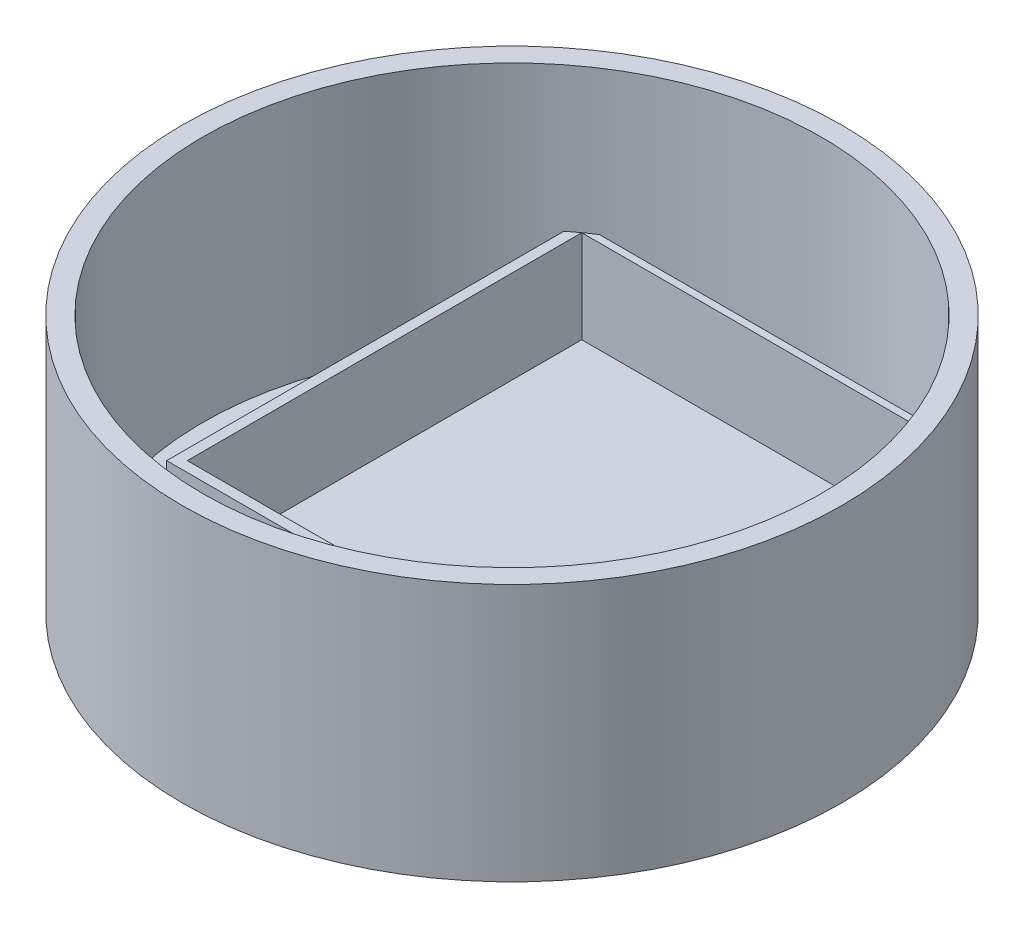
ISO-10303-21;
HEADER;
FILE_DESCRIPTION(('STEP AP214'),'2;1');
FILE_NAME('part.step','',(''),(''),'','','');
FILE_SCHEMA(('AUTOMOTIVE_DESIGN { 1 0 10303 214 1 1 1 1 }'));
ENDSEC;
DATA;
#1=APPLICATION_CONTEXT('core data for automotive mechanical design processes');
#2=APPLICATION_PROTOCOL_DEFINITION('international standard','automotive_design',2000,#1);
#3=PRODUCT_CONTEXT('',#1,'mechanical');
#4=PRODUCT('Part','Part','',(#3));
#5=PRODUCT_RELATED_PRODUCT_CATEGORY('part','',(#4));
#6=PRODUCT_DEFINITION_FORMATION('','',#4);
#7=PRODUCT_DEFINITION_CONTEXT('part definition',#1,'design');
#8=PRODUCT_DEFINITION('design','',#6,#7);
#9=PRODUCT_DEFINITION_SHAPE('','',#8);
#10=(LENGTH_UNIT() NAMED_UNIT(*) SI_UNIT(.MILLI.,.METRE.));
#11=(NAMED_UNIT(*) PLANE_ANGLE_UNIT() SI_UNIT($,.RADIAN.));
#12=(NAMED_UNIT(*) SI_UNIT($,.STERADIAN.) SOLID_ANGLE_UNIT());
#13=UNCERTAINTY_MEASURE_WITH_UNIT(LENGTH_MEASURE(1.E-05),#10,'distance_accuracy_value','');
#14=(GEOMETRIC_REPRESENTATION_CONTEXT(3) GLOBAL_UNCERTAINTY_ASSIGNED_CONTEXT((#13)) GLOBAL_UNIT_ASSIGNED_CONTEXT((#10,
#11,#12)) REPRESENTATION_CONTEXT('',''));
#15=CARTESIAN_POINT('',(0.,0.,0.));
#16=DIRECTION('',(0.,0.,1.));
#17=DIRECTION('',(1.,0.,0.));
#18=AXIS2_PLACEMENT_3D('',#15,#16,#17);
#19=CARTESIAN_POINT('',(1.22124532708767E-12,11.,1.70002900645727E-12));
#20=DIRECTION('',(0.,-1.,0.));
#21=DIRECTION('',(0.,0.,-1.));
#22=AXIS2_PLACEMENT_3D('',#19,#20,#21);
#23=PLANE('',#22);
#24=CARTESIAN_POINT('',(-2.36650976592756E-11,11.,3.27793348020577E-11));
#25=DIRECTION('',(0.,1.,0.));
#26=DIRECTION('',(0.,0.,-1.));
#27=AXIS2_PLACEMENT_3D('',#24,#25,#26);
#28=CIRCLE('',#27,30.0000000000404);
#29=CARTESIAN_POINT('',(18.5411966761781,11.,-23.5844021720984));
#30=VERTEX_POINT('',#29);
#31=CARTESIAN_POINT('',(17.5560360529173,11.,-24.3266437904752));
#32=VERTEX_POINT('',#31);
#33=EDGE_CURVE('E169',#30,#32,#28,.T.);
#34=ORIENTED_EDGE('',*,*,#33,.T.);
#35=DIRECTION('',(0.000387448230431341,0.,-0.999999924941932));
#36=VECTOR('',#35,1.);
#37=CARTESIAN_POINT('',(17.5411966761781,11.,13.9736359885557));
#38=LINE('',#37,#36);
#39=CARTESIAN_POINT('',(17.5411966761781,11.,13.9736359885557));
#40=VERTEX_POINT('',#39);
#41=EDGE_CURVE('E56',#40,#32,#38,.T.);
#42=ORIENTED_EDGE('',*,*,#41,.F.);
#43=DIRECTION('',(1.,0.,0.));
#44=VECTOR('',#43,1.);
#45=CARTESIAN_POINT('',(-17.5411966761781,11.,13.9736359885557));
#46=LINE('',#45,#44);
#47=CARTESIAN_POINT('',(-17.5411966761781,11.,13.9736359885557));
#48=VERTEX_POINT('',#47);
#49=EDGE_CURVE('E139',#48,#40,#46,.T.);
#50=ORIENTED_EDGE('',*,*,#49,.F.);
#51=DIRECTION('',(0.000387448230431703,0.,0.999999924941932));
#52=VECTOR('',#51,1.);
#53=CARTESIAN_POINT('',(-17.5560360529173,11.,-24.3266437904752));
#54=LINE('',#53,#52);
#55=CARTESIAN_POINT('',(-17.5560360529173,11.,-24.3266437904752));
#56=VERTEX_POINT('',#55);
#57=EDGE_CURVE('E142',#56,#48,#54,.T.);
#58=ORIENTED_EDGE('',*,*,#57,.F.);
#59=CARTESIAN_POINT('',(1.22124532708767E-12,11.,1.70002900645727E-12));
#60=DIRECTION('',(0.,1.,0.));
#61=DIRECTION('',(0.,0.,-1.));
#62=AXIS2_PLACEMENT_3D('',#59,#60,#61);
#63=CIRCLE('',#62,30.0000000000021);
#64=CARTESIAN_POINT('',(-18.5411966761781,11.,-23.5844021720985));
#65=VERTEX_POINT('',#64);
#66=EDGE_CURVE('E162',#56,#65,#63,.T.);
#67=ORIENTED_EDGE('',*,*,#66,.T.);
#68=DIRECTION('',(0.,0.,1.));
#69=VECTOR('',#68,1.);
#70=CARTESIAN_POINT('',(-18.5411966761781,11.,14.9722391628817));
#71=LINE('',#70,#69);
#72=CARTESIAN_POINT('',(-18.5411966761781,11.,14.9722391628817));
#73=VERTEX_POINT('',#72);
#74=EDGE_CURVE('E161',#65,#73,#71,.T.);
#75=ORIENTED_EDGE('',*,*,#74,.T.);
#76=DIRECTION('',(0.999999997162219,0.,7.53363252892753E-05));
#77=VECTOR('',#76,1.);
#78=CARTESIAN_POINT('',(-18.5411966761781,11.,14.9722391628817));
#79=LINE('',#78,#77);
#80=CARTESIAN_POINT('',(18.5411966761781,11.,14.9750328141377));
#81=VERTEX_POINT('',#80);
#82=EDGE_CURVE('E164',#73,#81,#79,.T.);
#83=ORIENTED_EDGE('',*,*,#82,.T.);
#84=DIRECTION('',(0.,0.,-1.));
#85=VECTOR('',#84,1.);
#86=CARTESIAN_POINT('',(18.5411966761781,11.,-23.5844021720984));
#87=LINE('',#86,#85);
#88=EDGE_CURVE('E166',#81,#30,#87,.T.);
#89=ORIENTED_EDGE('',*,*,#88,.T.);
#90=EDGE_LOOP('',(#34,#42,#50,#58,#67,#75,#83,#89));
#91=FACE_BOUND('',#90,.T.);
#92=ADVANCED_FACE('F41',(#91),#23,.F.);
#93=CARTESIAN_POINT('',(0.,1.,0.));
#94=DIRECTION('',(0.,1.,0.));
#95=DIRECTION('',(0.,0.,1.));
#96=AXIS2_PLACEMENT_3D('',#93,#94,#95);
#97=CYLINDRICAL_SURFACE('',#96,30.);
#98=CARTESIAN_POINT('',(0.,25.,0.));
#99=DIRECTION('',(0.,1.,0.));
#100=DIRECTION('',(0.,0.,1.));
#101=AXIS2_PLACEMENT_3D('',#98,#99,#100);
#102=CIRCLE('',#101,30.);
#103=CARTESIAN_POINT('',(0.,25.,30.));
#104=VERTEX_POINT('',#103);
#105=EDGE_CURVE('E196',#104,#104,#102,.T.);
#106=ORIENTED_EDGE('',*,*,#105,.T.);
#107=EDGE_LOOP('',(#106));
#108=FACE_BOUND('',#107,.T.);
#109=DIRECTION('',(0.,-1.,0.));
#110=VECTOR('',#109,1.);
#111=CARTESIAN_POINT('',(-18.5411966761781,11.,-23.5844021720985));
#112=LINE('',#111,#110);
#113=CARTESIAN_POINT('',(-18.5411966761781,1.,-23.5844021720985));
#114=VERTEX_POINT('',#113);
#115=EDGE_CURVE('E194',#65,#114,#112,.T.);
#116=ORIENTED_EDGE('',*,*,#115,.F.);
#117=ORIENTED_EDGE('',*,*,#66,.F.);
#118=CARTESIAN_POINT('',(-16.5411966761781,11.,-25.0277608371183));
#119=VERTEX_POINT('',#118);
#120=EDGE_CURVE('E158',#119,#56,#63,.T.);
#121=ORIENTED_EDGE('',*,*,#120,.F.);
#122=DIRECTION('',(0.,-1.,0.));
#123=VECTOR('',#122,1.);
#124=CARTESIAN_POINT('',(-16.5411966761781,11.,-25.0277608371183));
#125=LINE('',#124,#123);
#126=CARTESIAN_POINT('',(-16.5411966761781,1.,-25.0277608371183));
#127=VERTEX_POINT('',#126);
#128=EDGE_CURVE('E174',#119,#127,#125,.T.);
#129=ORIENTED_EDGE('',*,*,#128,.T.);
#130=CARTESIAN_POINT('',(0.,1.,0.));
#131=DIRECTION('',(0.,1.,0.));
#132=DIRECTION('',(0.,0.,1.));
#133=AXIS2_PLACEMENT_3D('',#130,#131,#132);
#134=CIRCLE('',#133,30.);
#135=CARTESIAN_POINT('',(16.5411966761781,1.,-25.0277608371183));
#136=VERTEX_POINT('',#135);
#137=EDGE_CURVE('E200',#136,#127,#134,.T.);
#138=ORIENTED_EDGE('',*,*,#137,.F.);
#139=DIRECTION('',(0.,-1.,0.));
#140=VECTOR('',#139,1.);
#141=CARTESIAN_POINT('',(16.5411966761781,11.,-25.0277608371183));
#142=LINE('',#141,#140);
#143=CARTESIAN_POINT('',(16.5411966761781,11.,-25.0277608371183));
#144=VERTEX_POINT('',#143);
#145=EDGE_CURVE('E64',#144,#136,#142,.T.);
#146=ORIENTED_EDGE('',*,*,#145,.F.);
#147=EDGE_CURVE('E168',#32,#144,#28,.T.);
#148=ORIENTED_EDGE('',*,*,#147,.F.);
#149=ORIENTED_EDGE('',*,*,#33,.F.);
#150=DIRECTION('',(0.,-1.,0.));
#151=VECTOR('',#150,1.);
#152=CARTESIAN_POINT('',(18.5411966761781,11.,-23.5844021720984));
#153=LINE('',#152,#151);
#154=CARTESIAN_POINT('',(18.5411966761781,1.,-23.5844021720984));
#155=VERTEX_POINT('',#154);
#156=EDGE_CURVE('E185',#30,#155,#153,.T.);
#157=ORIENTED_EDGE('',*,*,#156,.T.);
#158=EDGE_CURVE('E197',#114,#155,#134,.T.);
#159=ORIENTED_EDGE('',*,*,#158,.F.);
#160=EDGE_LOOP('',(#116,#117,#121,#129,#138,#146,#148,#149,#157,#159));
#161=FACE_BOUND('',#160,.T.);
#162=ADVANCED_FACE('F204',(#108,#161),#97,.F.);
#163=CARTESIAN_POINT('',(0.,1.,0.));
#164=DIRECTION('',(0.,1.,0.));
#165=DIRECTION('',(0.,0.,1.));
#166=AXIS2_PLACEMENT_3D('',#163,#164,#165);
#167=PLANE('',#166);
#168=DIRECTION('',(0.999999997162219,0.,7.53363252892753E-05));
#169=VECTOR('',#168,1.);
#170=CARTESIAN_POINT('',(-18.5411966761781,1.,14.9722391628817));
#171=LINE('',#170,#169);
#172=CARTESIAN_POINT('',(-18.5411966761781,1.,14.9722391628817));
#173=VERTEX_POINT('',#172);
#174=CARTESIAN_POINT('',(18.5411966761781,1.,14.9750328141377));
#175=VERTEX_POINT('',#174);
#176=EDGE_CURVE('E176',#173,#175,#171,.T.);
#177=ORIENTED_EDGE('',*,*,#176,.F.);
#178=DIRECTION('',(0.,0.,1.));
#179=VECTOR('',#178,1.);
#180=CARTESIAN_POINT('',(-18.5411966761781,1.,14.9722391628817));
#181=LINE('',#180,#179);
#182=EDGE_CURVE('E154',#114,#173,#181,.T.);
#183=ORIENTED_EDGE('',*,*,#182,.F.);
#184=ORIENTED_EDGE('',*,*,#158,.T.);
#185=DIRECTION('',(0.,0.,-1.));
#186=VECTOR('',#185,1.);
#187=CARTESIAN_POINT('',(18.5411966761781,1.,-23.5844021720984));
#188=LINE('',#187,#186);
#189=EDGE_CURVE('E178',#175,#155,#188,.T.);
#190=ORIENTED_EDGE('',*,*,#189,.F.);
#191=EDGE_LOOP('',(#177,#183,#184,#190));
#192=FACE_BOUND('',#191,.T.);
#193=ADVANCED_FACE('F245',(#192),#167,.T.);
#194=ORIENTED_EDGE('',*,*,#137,.T.);
#195=DIRECTION('',(-1.,0.,0.));
#196=VECTOR('',#195,1.);
#197=CARTESIAN_POINT('',(16.5411966761781,1.,-25.0277608371183));
#198=LINE('',#197,#196);
#199=EDGE_CURVE('E180',#136,#127,#198,.T.);
#200=ORIENTED_EDGE('',*,*,#199,.F.);
#201=EDGE_LOOP('',(#194,#200));
#202=FACE_BOUND('',#201,.T.);
#203=ADVANCED_FACE('F216',(#202),#167,.T.);
#204=CARTESIAN_POINT('',(0.,25.,0.));
#205=DIRECTION('',(0.,-1.,0.));
#206=DIRECTION('',(0.,0.,-1.));
#207=AXIS2_PLACEMENT_3D('',#204,#205,#206);
#208=CYLINDRICAL_SURFACE('',#207,32.);
#209=CARTESIAN_POINT('',(0.,25.,0.));
#210=DIRECTION('',(0.,1.,0.));
#211=DIRECTION('',(0.,0.,1.));
#212=AXIS2_PLACEMENT_3D('',#209,#210,#211);
#213=CIRCLE('',#212,32.);
#214=CARTESIAN_POINT('',(0.,25.,32.));
#215=VERTEX_POINT('',#214);
#216=EDGE_CURVE('E11',#215,#215,#213,.T.);
#217=ORIENTED_EDGE('',*,*,#216,.F.);
#218=EDGE_LOOP('',(#217));
#219=FACE_BOUND('',#218,.T.);
#220=CARTESIAN_POINT('',(0.,0.,0.));
#221=DIRECTION('',(0.,1.,0.));
#222=DIRECTION('',(0.,0.,1.));
#223=AXIS2_PLACEMENT_3D('',#220,#221,#222);
#224=CIRCLE('',#223,32.);
#225=CARTESIAN_POINT('',(0.,0.,32.));
#226=VERTEX_POINT('',#225);
#227=EDGE_CURVE('E45',#226,#226,#224,.T.);
#228=ORIENTED_EDGE('',*,*,#227,.T.);
#229=EDGE_LOOP('',(#228));
#230=FACE_BOUND('',#229,.T.);
#231=ADVANCED_FACE('F43',(#219,#230),#208,.T.);
#232=CARTESIAN_POINT('',(0.,25.,0.));
#233=DIRECTION('',(0.,1.,0.));
#234=DIRECTION('',(0.,0.,1.));
#235=AXIS2_PLACEMENT_3D('',#232,#233,#234);
#236=PLANE('',#235);
#237=ORIENTED_EDGE('',*,*,#105,.F.);
#238=EDGE_LOOP('',(#237));
#239=FACE_BOUND('',#238,.T.);
#240=ORIENTED_EDGE('',*,*,#216,.T.);
#241=EDGE_LOOP('',(#240));
#242=FACE_BOUND('',#241,.T.);
#243=ADVANCED_FACE('F207',(#239,#242),#236,.T.);
#244=CARTESIAN_POINT('',(0.,0.,0.));
#245=DIRECTION('',(0.,1.,0.));
#246=DIRECTION('',(0.,0.,1.));
#247=AXIS2_PLACEMENT_3D('',#244,#245,#246);
#248=PLANE('',#247);
#249=ORIENTED_EDGE('',*,*,#227,.F.);
#250=EDGE_LOOP('',(#249));
#251=FACE_BOUND('',#250,.T.);
#252=ADVANCED_FACE('F210',(#251),#248,.F.);
#253=CARTESIAN_POINT('',(-18.5411966761781,11.,14.9722391628817));
#254=DIRECTION('',(1.,0.,0.));
#255=DIRECTION('',(0.,0.,-1.));
#256=AXIS2_PLACEMENT_3D('',#253,#254,#255);
#257=PLANE('',#256);
#258=ORIENTED_EDGE('',*,*,#182,.T.);
#259=DIRECTION('',(0.,-1.,0.));
#260=VECTOR('',#259,1.);
#261=CARTESIAN_POINT('',(-18.5411966761781,11.,14.9722391628817));
#262=LINE('',#261,#260);
#263=EDGE_CURVE('E191',#73,#173,#262,.T.);
#264=ORIENTED_EDGE('',*,*,#263,.F.);
#265=ORIENTED_EDGE('',*,*,#74,.F.);
#266=ORIENTED_EDGE('',*,*,#115,.T.);
#267=EDGE_LOOP('',(#258,#264,#265,#266));
#268=FACE_BOUND('',#267,.T.);
#269=ADVANCED_FACE('F248',(#268),#257,.F.);
#270=CARTESIAN_POINT('',(-18.5411966761781,11.,14.9722391628817));
#271=DIRECTION('',(7.53363252892753E-05,0.,-0.999999997162219));
#272=DIRECTION('',(-0.999999997162219,0.,-7.53363252892753E-05));
#273=AXIS2_PLACEMENT_3D('',#270,#271,#272);
#274=PLANE('',#273);
#275=ORIENTED_EDGE('',*,*,#176,.T.);
#276=DIRECTION('',(0.,-1.,0.));
#277=VECTOR('',#276,1.);
#278=CARTESIAN_POINT('',(18.5411966761781,11.,14.9750328141377));
#279=LINE('',#278,#277);
#280=EDGE_CURVE('E188',#81,#175,#279,.T.);
#281=ORIENTED_EDGE('',*,*,#280,.F.);
#282=ORIENTED_EDGE('',*,*,#82,.F.);
#283=ORIENTED_EDGE('',*,*,#263,.T.);
#284=EDGE_LOOP('',(#275,#281,#282,#283));
#285=FACE_BOUND('',#284,.T.);
#286=ADVANCED_FACE('F251',(#285),#274,.F.);
#287=CARTESIAN_POINT('',(18.5411966761781,11.,-23.5844021720984));
#288=DIRECTION('',(-1.,0.,0.));
#289=DIRECTION('',(0.,0.,1.));
#290=AXIS2_PLACEMENT_3D('',#287,#288,#289);
#291=PLANE('',#290);
#292=ORIENTED_EDGE('',*,*,#189,.T.);
#293=ORIENTED_EDGE('',*,*,#156,.F.);
#294=ORIENTED_EDGE('',*,*,#88,.F.);
#295=ORIENTED_EDGE('',*,*,#280,.T.);
#296=EDGE_LOOP('',(#292,#293,#294,#295));
#297=FACE_BOUND('',#296,.T.);
#298=ADVANCED_FACE('F239',(#297),#291,.F.);
#299=CARTESIAN_POINT('',(16.5411966761781,11.,-25.0277608371183));
#300=DIRECTION('',(0.,0.,1.));
#301=DIRECTION('',(1.,0.,0.));
#302=AXIS2_PLACEMENT_3D('',#299,#300,#301);
#303=PLANE('',#302);
#304=ORIENTED_EDGE('',*,*,#199,.T.);
#305=ORIENTED_EDGE('',*,*,#128,.F.);
#306=DIRECTION('',(-1.,0.,0.));
#307=VECTOR('',#306,1.);
#308=CARTESIAN_POINT('',(16.5411966761781,11.,-25.0277608371183));
#309=LINE('',#308,#307);
#310=EDGE_CURVE('E172',#144,#119,#309,.T.);
#311=ORIENTED_EDGE('',*,*,#310,.F.);
#312=ORIENTED_EDGE('',*,*,#145,.T.);
#313=EDGE_LOOP('',(#304,#305,#311,#312));
#314=FACE_BOUND('',#313,.T.);
#315=ADVANCED_FACE('F228',(#314),#303,.F.);
#316=ORIENTED_EDGE('',*,*,#120,.T.);
#317=DIRECTION('',(-1.,0.,0.));
#318=VECTOR('',#317,1.);
#319=CARTESIAN_POINT('',(17.5560360529173,11.,-24.3266437904752));
#320=LINE('',#319,#318);
#321=EDGE_CURVE('E148',#32,#56,#320,.T.);
#322=ORIENTED_EDGE('',*,*,#321,.F.);
#323=ORIENTED_EDGE('',*,*,#147,.T.);
#324=ORIENTED_EDGE('',*,*,#310,.T.);
#325=EDGE_LOOP('',(#316,#322,#323,#324));
#326=FACE_BOUND('',#325,.T.);
#327=ADVANCED_FACE('F230',(#326),#23,.F.);
#328=CARTESIAN_POINT('',(17.5411966761781,2.,13.9736359885557));
#329=DIRECTION('',(0.999999924941931,0.,0.000387448230431341));
#330=DIRECTION('',(0.000387448230431341,0.,-0.999999924941932));
#331=AXIS2_PLACEMENT_3D('',#328,#329,#330);
#332=PLANE('',#331);
#333=ORIENTED_EDGE('',*,*,#41,.T.);
#334=DIRECTION('',(0.,1.,0.));
#335=VECTOR('',#334,1.);
#336=CARTESIAN_POINT('',(17.5560360529173,2.,-24.3266437904752));
#337=LINE('',#336,#335);
#338=CARTESIAN_POINT('',(17.5560360529173,2.,-24.3266437904752));
#339=VERTEX_POINT('',#338);
#340=EDGE_CURVE('E117',#339,#32,#337,.T.);
#341=ORIENTED_EDGE('',*,*,#340,.F.);
#342=DIRECTION('',(0.000387448230431341,0.,-0.999999924941932));
#343=VECTOR('',#342,1.);
#344=CARTESIAN_POINT('',(17.5411966761781,2.,13.9736359885557));
#345=LINE('',#344,#343);
#346=CARTESIAN_POINT('',(17.5411966761781,2.,13.9736359885557));
#347=VERTEX_POINT('',#346);
#348=EDGE_CURVE('E121',#347,#339,#345,.T.);
#349=ORIENTED_EDGE('',*,*,#348,.F.);
#350=DIRECTION('',(0.,1.,0.));
#351=VECTOR('',#350,1.);
#352=CARTESIAN_POINT('',(17.5411966761781,2.,13.9736359885557));
#353=LINE('',#352,#351);
#354=EDGE_CURVE('E152',#347,#40,#353,.T.);
#355=ORIENTED_EDGE('',*,*,#354,.T.);
#356=EDGE_LOOP('',(#333,#341,#349,#355));
#357=FACE_BOUND('',#356,.T.);
#358=ADVANCED_FACE('F119',(#357),#332,.F.);
#359=CARTESIAN_POINT('',(-17.5411966761781,2.,13.9736359885557));
#360=DIRECTION('',(0.,0.,1.));
#361=DIRECTION('',(1.,0.,0.));
#362=AXIS2_PLACEMENT_3D('',#359,#360,#361);
#363=PLANE('',#362);
#364=ORIENTED_EDGE('',*,*,#49,.T.);
#365=ORIENTED_EDGE('',*,*,#354,.F.);
#366=DIRECTION('',(1.,0.,0.));
#367=VECTOR('',#366,1.);
#368=CARTESIAN_POINT('',(-17.5411966761781,2.,13.9736359885557));
#369=LINE('',#368,#367);
#370=CARTESIAN_POINT('',(-17.5411966761781,2.,13.9736359885557));
#371=VERTEX_POINT('',#370);
#372=EDGE_CURVE('E127',#371,#347,#369,.T.);
#373=ORIENTED_EDGE('',*,*,#372,.F.);
#374=DIRECTION('',(0.,1.,0.));
#375=VECTOR('',#374,1.);
#376=CARTESIAN_POINT('',(-17.5411966761781,2.,13.9736359885557));
#377=LINE('',#376,#375);
#378=EDGE_CURVE('E155',#371,#48,#377,.T.);
#379=ORIENTED_EDGE('',*,*,#378,.T.);
#380=EDGE_LOOP('',(#364,#365,#373,#379));
#381=FACE_BOUND('',#380,.T.);
#382=ADVANCED_FACE('F273',(#381),#363,.F.);
#383=CARTESIAN_POINT('',(-17.5560360529173,2.,-24.3266437904752));
#384=DIRECTION('',(-0.999999924941931,0.,0.000387448230431703));
#385=DIRECTION('',(0.000387448230431703,0.,0.999999924941932));
#386=AXIS2_PLACEMENT_3D('',#383,#384,#385);
#387=PLANE('',#386);
#388=ORIENTED_EDGE('',*,*,#57,.T.);
#389=ORIENTED_EDGE('',*,*,#378,.F.);
#390=DIRECTION('',(0.000387448230431703,0.,0.999999924941932));
#391=VECTOR('',#390,1.);
#392=CARTESIAN_POINT('',(-17.5560360529173,2.,-24.3266437904752));
#393=LINE('',#392,#391);
#394=CARTESIAN_POINT('',(-17.5560360529173,2.,-24.3266437904752));
#395=VERTEX_POINT('',#394);
#396=EDGE_CURVE('E135',#395,#371,#393,.T.);
#397=ORIENTED_EDGE('',*,*,#396,.F.);
#398=DIRECTION('',(0.,1.,0.));
#399=VECTOR('',#398,1.);
#400=CARTESIAN_POINT('',(-17.5560360529173,2.,-24.3266437904752));
#401=LINE('',#400,#399);
#402=EDGE_CURVE('E126',#395,#56,#401,.T.);
#403=ORIENTED_EDGE('',*,*,#402,.T.);
#404=EDGE_LOOP('',(#388,#389,#397,#403));
#405=FACE_BOUND('',#404,.T.);
#406=ADVANCED_FACE('F354',(#405),#387,.F.);
#407=CARTESIAN_POINT('',(17.5560360529173,2.,-24.3266437904752));
#408=DIRECTION('',(0.,0.,-1.));
#409=DIRECTION('',(-1.,0.,0.));
#410=AXIS2_PLACEMENT_3D('',#407,#408,#409);
#411=PLANE('',#410);
#412=ORIENTED_EDGE('',*,*,#321,.T.);
#413=ORIENTED_EDGE('',*,*,#402,.F.);
#414=DIRECTION('',(-1.,0.,0.));
#415=VECTOR('',#414,1.);
#416=CARTESIAN_POINT('',(17.5560360529173,2.,-24.3266437904752));
#417=LINE('',#416,#415);
#418=EDGE_CURVE('E130',#339,#395,#417,.T.);
#419=ORIENTED_EDGE('',*,*,#418,.F.);
#420=ORIENTED_EDGE('',*,*,#340,.T.);
#421=EDGE_LOOP('',(#412,#413,#419,#420));
#422=FACE_BOUND('',#421,.T.);
#423=ADVANCED_FACE('F131',(#422),#411,.F.);
#424=CARTESIAN_POINT('',(0.,2.,0.));
#425=DIRECTION('',(0.,1.,0.));
#426=DIRECTION('',(0.,0.,1.));
#427=AXIS2_PLACEMENT_3D('',#424,#425,#426);
#428=PLANE('',#427);
#429=ORIENTED_EDGE('',*,*,#348,.T.);
#430=ORIENTED_EDGE('',*,*,#418,.T.);
#431=ORIENTED_EDGE('',*,*,#396,.T.);
#432=ORIENTED_EDGE('',*,*,#372,.T.);
#433=EDGE_LOOP('',(#429,#430,#431,#432));
#434=FACE_BOUND('',#433,.T.);
#435=ADVANCED_FACE('F137',(#434),#428,.T.);
#436=CLOSED_SHELL('',(#92,#162,#193,#203,#231,#243,#252,#269,#286,#298,#315,#327,#358,#382,#406,
#423,#435));
#437=MANIFOLD_SOLID_BREP('B2',#436);
#438=ADVANCED_BREP_SHAPE_REPRESENTATION('',(#18,#437),#14);
#439=SHAPE_DEFINITION_REPRESENTATION(#9,#438);
ENDSEC;
END-ISO-10303-21;
